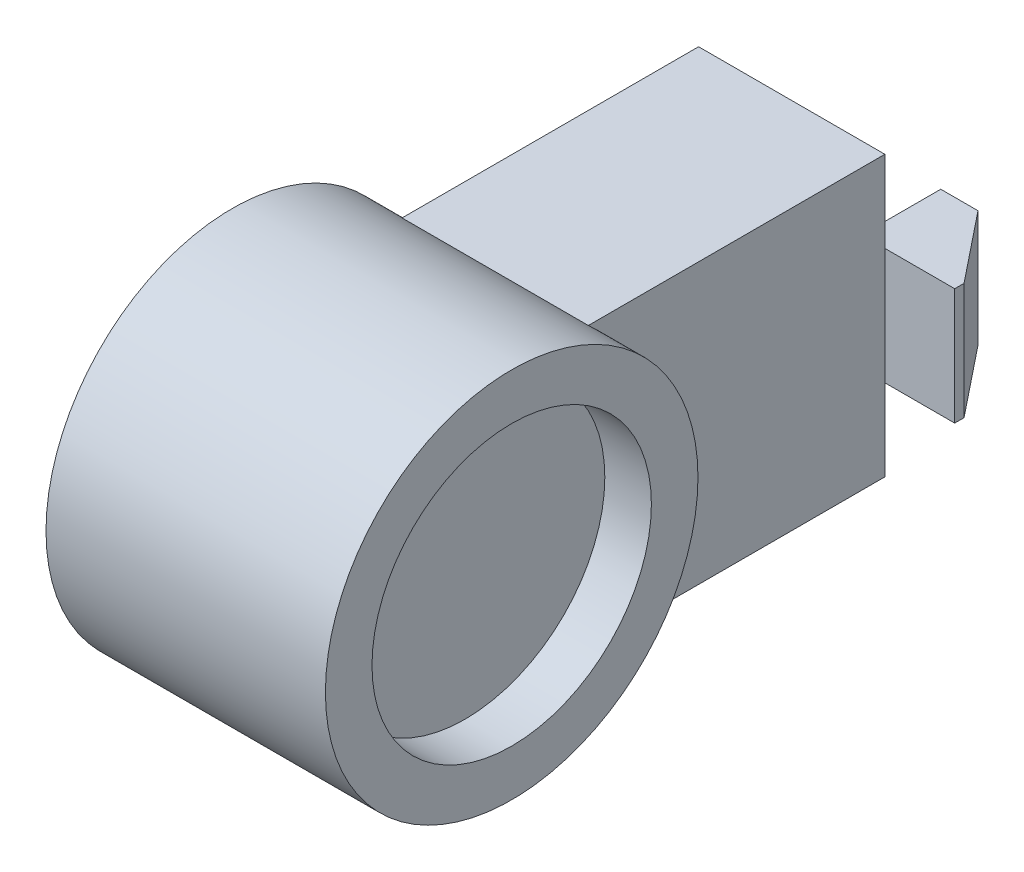
ISO-10303-21;
HEADER;
FILE_DESCRIPTION(('STEP AP214'),'2;1');
FILE_NAME('part.step','',(''),(''),'','','');
FILE_SCHEMA(('AUTOMOTIVE_DESIGN { 1 0 10303 214 1 1 1 1 }'));
ENDSEC;
DATA;
#1=APPLICATION_CONTEXT('core data for automotive mechanical design processes');
#2=APPLICATION_PROTOCOL_DEFINITION('international standard','automotive_design',2000,#1);
#3=PRODUCT_CONTEXT('',#1,'mechanical');
#4=PRODUCT('Part','Part','',(#3));
#5=PRODUCT_RELATED_PRODUCT_CATEGORY('part','',(#4));
#6=PRODUCT_DEFINITION_FORMATION('','',#4);
#7=PRODUCT_DEFINITION_CONTEXT('part definition',#1,'design');
#8=PRODUCT_DEFINITION('design','',#6,#7);
#9=PRODUCT_DEFINITION_SHAPE('','',#8);
#10=(LENGTH_UNIT() NAMED_UNIT(*) SI_UNIT(.MILLI.,.METRE.));
#11=(NAMED_UNIT(*) PLANE_ANGLE_UNIT() SI_UNIT($,.RADIAN.));
#12=(NAMED_UNIT(*) SI_UNIT($,.STERADIAN.) SOLID_ANGLE_UNIT());
#13=UNCERTAINTY_MEASURE_WITH_UNIT(LENGTH_MEASURE(1.E-05),#10,'distance_accuracy_value','');
#14=(GEOMETRIC_REPRESENTATION_CONTEXT(3) GLOBAL_UNCERTAINTY_ASSIGNED_CONTEXT((#13)) GLOBAL_UNIT_ASSIGNED_CONTEXT((#10,
#11,#12)) REPRESENTATION_CONTEXT('',''));
#15=CARTESIAN_POINT('',(0.,0.,0.));
#16=DIRECTION('',(0.,0.,1.));
#17=DIRECTION('',(1.,0.,0.));
#18=AXIS2_PLACEMENT_3D('',#15,#16,#17);
#19=CARTESIAN_POINT('',(0.,0.,-92.1328056902551));
#20=DIRECTION('',(0.,0.,-1.));
#21=DIRECTION('',(-1.,0.,0.));
#22=AXIS2_PLACEMENT_3D('',#19,#20,#21);
#23=PLANE('',#22);
#24=DIRECTION('',(0.,1.,0.));
#25=VECTOR('',#24,1.);
#26=CARTESIAN_POINT('',(45.,-12.5000000000007,-92.1328056902551));
#27=LINE('',#26,#25);
#28=CARTESIAN_POINT('',(45.,-12.5000000000007,-92.1328056902551));
#29=VERTEX_POINT('',#28);
#30=CARTESIAN_POINT('',(45.,12.4999999999994,-92.1328056902551));
#31=VERTEX_POINT('',#30);
#32=EDGE_CURVE('E170',#29,#31,#27,.T.);
#33=ORIENTED_EDGE('',*,*,#32,.F.);
#34=DIRECTION('',(-1.,0.,0.));
#35=VECTOR('',#34,1.);
#36=CARTESIAN_POINT('',(65.,-12.5000000000006,-92.1328056902551));
#37=LINE('',#36,#35);
#38=CARTESIAN_POINT('',(15.,-12.5000000000007,-92.1328056902551));
#39=VERTEX_POINT('',#38);
#40=EDGE_CURVE('E181',#29,#39,#37,.T.);
#41=ORIENTED_EDGE('',*,*,#40,.T.);
#42=DIRECTION('',(0.,1.,0.));
#43=VECTOR('',#42,1.);
#44=CARTESIAN_POINT('',(15.,-12.5000000000007,-92.1328056902551));
#45=LINE('',#44,#43);
#46=CARTESIAN_POINT('',(15.,12.4999999999994,-92.1328056902551));
#47=VERTEX_POINT('',#46);
#48=EDGE_CURVE('E220',#39,#47,#45,.T.);
#49=ORIENTED_EDGE('',*,*,#48,.T.);
#50=DIRECTION('',(1.,0.,0.));
#51=VECTOR('',#50,1.);
#52=CARTESIAN_POINT('',(65.,12.4999999999994,-92.1328056902551));
#53=LINE('',#52,#51);
#54=EDGE_CURVE('E59',#47,#31,#53,.T.);
#55=ORIENTED_EDGE('',*,*,#54,.T.);
#56=EDGE_LOOP('',(#33,#41,#49,#55));
#57=FACE_BOUND('',#56,.T.);
#58=ADVANCED_FACE('F39',(#57),#23,.T.);
#59=CARTESIAN_POINT('',(0.,0.,-90.1328056902551));
#60=DIRECTION('',(0.,0.,1.));
#61=DIRECTION('',(1.,0.,0.));
#62=AXIS2_PLACEMENT_3D('',#59,#60,#61);
#63=PLANE('',#62);
#64=DIRECTION('',(-1.,0.,0.));
#65=VECTOR('',#64,1.);
#66=CARTESIAN_POINT('',(65.,-12.5000000000006,-90.1328056902551));
#67=LINE('',#66,#65);
#68=CARTESIAN_POINT('',(50.,-12.5000000000006,-90.1328056902551));
#69=VERTEX_POINT('',#68);
#70=CARTESIAN_POINT('',(10.,-12.5000000000006,-90.1328056902551));
#71=VERTEX_POINT('',#70);
#72=EDGE_CURVE('E11',#69,#71,#67,.T.);
#73=ORIENTED_EDGE('',*,*,#72,.F.);
#74=DIRECTION('',(0.,1.,0.));
#75=VECTOR('',#74,1.);
#76=CARTESIAN_POINT('',(50.,29.9999999999994,-90.1328056902551));
#77=LINE('',#76,#75);
#78=CARTESIAN_POINT('',(50.,-30.0000000000006,-90.1328056902551));
#79=VERTEX_POINT('',#78);
#80=EDGE_CURVE('E297',#79,#69,#77,.T.);
#81=ORIENTED_EDGE('',*,*,#80,.F.);
#82=DIRECTION('',(1.,0.,0.));
#83=VECTOR('',#82,1.);
#84=CARTESIAN_POINT('',(10.,-30.0000000000006,-90.1328056902551));
#85=LINE('',#84,#83);
#86=CARTESIAN_POINT('',(10.,-30.0000000000006,-90.1328056902551));
#87=VERTEX_POINT('',#86);
#88=EDGE_CURVE('E279',#87,#79,#85,.T.);
#89=ORIENTED_EDGE('',*,*,#88,.F.);
#90=DIRECTION('',(0.,-1.,0.));
#91=VECTOR('',#90,1.);
#92=CARTESIAN_POINT('',(10.,29.9999999999994,-90.1328056902551));
#93=LINE('',#92,#91);
#94=EDGE_CURVE('E290',#71,#87,#93,.T.);
#95=ORIENTED_EDGE('',*,*,#94,.F.);
#96=EDGE_LOOP('',(#73,#81,#89,#95));
#97=FACE_BOUND('',#96,.T.);
#98=ADVANCED_FACE('F352',(#97),#63,.F.);
#99=DIRECTION('',(1.,0.,0.));
#100=VECTOR('',#99,1.);
#101=CARTESIAN_POINT('',(65.,12.4999999999994,-90.1328056902551));
#102=LINE('',#101,#100);
#103=CARTESIAN_POINT('',(10.,12.4999999999994,-90.1328056902551));
#104=VERTEX_POINT('',#103);
#105=CARTESIAN_POINT('',(50.,12.4999999999994,-90.1328056902551));
#106=VERTEX_POINT('',#105);
#107=EDGE_CURVE('E49',#104,#106,#102,.T.);
#108=ORIENTED_EDGE('',*,*,#107,.F.);
#109=CARTESIAN_POINT('',(10.,29.9999999999994,-90.1328056902551));
#110=VERTEX_POINT('',#109);
#111=EDGE_CURVE('E285',#110,#104,#93,.T.);
#112=ORIENTED_EDGE('',*,*,#111,.F.);
#113=DIRECTION('',(-1.,0.,0.));
#114=VECTOR('',#113,1.);
#115=CARTESIAN_POINT('',(10.,29.9999999999994,-90.1328056902551));
#116=LINE('',#115,#114);
#117=CARTESIAN_POINT('',(50.,29.9999999999994,-90.1328056902551));
#118=VERTEX_POINT('',#117);
#119=EDGE_CURVE('E291',#118,#110,#116,.T.);
#120=ORIENTED_EDGE('',*,*,#119,.F.);
#121=EDGE_CURVE('E302',#106,#118,#77,.T.);
#122=ORIENTED_EDGE('',*,*,#121,.F.);
#123=EDGE_LOOP('',(#108,#112,#120,#122));
#124=FACE_BOUND('',#123,.T.);
#125=ADVANCED_FACE('F357',(#124),#63,.F.);
#126=CARTESIAN_POINT('',(60.,0.,0.));
#127=DIRECTION('',(-1.,0.,0.));
#128=DIRECTION('',(0.,0.,1.));
#129=AXIS2_PLACEMENT_3D('',#126,#127,#128);
#130=CYLINDRICAL_SURFACE('',#129,40.);
#131=CARTESIAN_POINT('',(0.,0.,0.));
#132=DIRECTION('',(1.,0.,0.));
#133=DIRECTION('',(0.,0.,-1.));
#134=AXIS2_PLACEMENT_3D('',#131,#132,#133);
#135=CIRCLE('',#134,40.);
#136=CARTESIAN_POINT('',(0.,0.,-40.));
#137=VERTEX_POINT('',#136);
#138=EDGE_CURVE('E43',#137,#137,#135,.T.);
#139=ORIENTED_EDGE('',*,*,#138,.T.);
#140=EDGE_LOOP('',(#139));
#141=FACE_BOUND('',#140,.T.);
#142=CARTESIAN_POINT('',(60.,0.,0.));
#143=DIRECTION('',(1.,0.,0.));
#144=DIRECTION('',(0.,0.,-1.));
#145=AXIS2_PLACEMENT_3D('',#142,#143,#144);
#146=CIRCLE('',#145,40.);
#147=CARTESIAN_POINT('',(60.,0.,-40.));
#148=VERTEX_POINT('',#147);
#149=EDGE_CURVE('E323',#148,#148,#146,.T.);
#150=ORIENTED_EDGE('',*,*,#149,.F.);
#151=EDGE_LOOP('',(#150));
#152=FACE_BOUND('',#151,.T.);
#153=CARTESIAN_POINT('',(50.,0.,0.));
#154=DIRECTION('',(-1.,0.,0.));
#155=DIRECTION('',(0.,-1.,0.));
#156=AXIS2_PLACEMENT_3D('',#153,#154,#155);
#157=CIRCLE('',#156,40.);
#158=CARTESIAN_POINT('',(50.,-30.0000000000006,-26.4575131106452));
#159=VERTEX_POINT('',#158);
#160=CARTESIAN_POINT('',(50.,29.9999999999994,-26.4575131106466));
#161=VERTEX_POINT('',#160);
#162=EDGE_CURVE('E283',#159,#161,#157,.F.);
#163=ORIENTED_EDGE('',*,*,#162,.T.);
#164=DIRECTION('',(-1.,0.,0.));
#165=VECTOR('',#164,1.);
#166=CARTESIAN_POINT('',(60.,29.9999999999994,-26.4575131106466));
#167=LINE('',#166,#165);
#168=CARTESIAN_POINT('',(10.,29.9999999999994,-26.4575131106466));
#169=VERTEX_POINT('',#168);
#170=EDGE_CURVE('E319',#161,#169,#167,.T.);
#171=ORIENTED_EDGE('',*,*,#170,.T.);
#172=CARTESIAN_POINT('',(10.,0.,0.));
#173=DIRECTION('',(1.,0.,0.));
#174=DIRECTION('',(0.,1.,0.));
#175=AXIS2_PLACEMENT_3D('',#172,#173,#174);
#176=CIRCLE('',#175,40.);
#177=CARTESIAN_POINT('',(10.,-30.0000000000006,-26.4575131106452));
#178=VERTEX_POINT('',#177);
#179=EDGE_CURVE('E316',#169,#178,#176,.F.);
#180=ORIENTED_EDGE('',*,*,#179,.T.);
#181=DIRECTION('',(-1.,0.,0.));
#182=VECTOR('',#181,1.);
#183=CARTESIAN_POINT('',(60.,-30.0000000000006,-26.4575131106452));
#184=LINE('',#183,#182);
#185=EDGE_CURVE('E313',#178,#159,#184,.F.);
#186=ORIENTED_EDGE('',*,*,#185,.T.);
#187=EDGE_LOOP('',(#163,#171,#180,#186));
#188=FACE_BOUND('',#187,.T.);
#189=ADVANCED_FACE('F41',(#141,#152,#188),#130,.T.);
#190=CARTESIAN_POINT('',(60.,0.,0.));
#191=DIRECTION('',(1.,0.,0.));
#192=DIRECTION('',(0.,0.,-1.));
#193=AXIS2_PLACEMENT_3D('',#190,#191,#192);
#194=PLANE('',#193);
#195=CARTESIAN_POINT('',(60.,0.,0.));
#196=DIRECTION('',(1.,0.,0.));
#197=DIRECTION('',(0.,0.,-1.));
#198=AXIS2_PLACEMENT_3D('',#195,#196,#197);
#199=CIRCLE('',#198,30.);
#200=CARTESIAN_POINT('',(60.,0.,-30.));
#201=VERTEX_POINT('',#200);
#202=EDGE_CURVE('E193',#201,#201,#199,.T.);
#203=ORIENTED_EDGE('',*,*,#202,.F.);
#204=EDGE_LOOP('',(#203));
#205=FACE_BOUND('',#204,.T.);
#206=ORIENTED_EDGE('',*,*,#149,.T.);
#207=EDGE_LOOP('',(#206));
#208=FACE_BOUND('',#207,.T.);
#209=ADVANCED_FACE('F339',(#205,#208),#194,.T.);
#210=CARTESIAN_POINT('',(0.,0.,0.));
#211=DIRECTION('',(1.,0.,0.));
#212=DIRECTION('',(0.,0.,-1.));
#213=AXIS2_PLACEMENT_3D('',#210,#211,#212);
#214=PLANE('',#213);
#215=CARTESIAN_POINT('',(0.,0.,0.));
#216=DIRECTION('',(-1.,0.,0.));
#217=DIRECTION('',(0.,0.,1.));
#218=AXIS2_PLACEMENT_3D('',#215,#216,#217);
#219=CIRCLE('',#218,6.);
#220=CARTESIAN_POINT('',(0.,0.,6.));
#221=VERTEX_POINT('',#220);
#222=EDGE_CURVE('E473',#221,#221,#219,.T.);
#223=ORIENTED_EDGE('',*,*,#222,.F.);
#224=EDGE_LOOP('',(#223));
#225=FACE_BOUND('',#224,.T.);
#226=ORIENTED_EDGE('',*,*,#138,.F.);
#227=EDGE_LOOP('',(#226));
#228=FACE_BOUND('',#227,.T.);
#229=ADVANCED_FACE('F336',(#225,#228),#214,.F.);
#230=CARTESIAN_POINT('',(50.,29.9999999999994,40.001));
#231=DIRECTION('',(-1.,0.,0.));
#232=DIRECTION('',(0.,-1.,0.));
#233=AXIS2_PLACEMENT_3D('',#230,#231,#232);
#234=PLANE('',#233);
#235=ORIENTED_EDGE('',*,*,#162,.F.);
#236=DIRECTION('',(0.,0.,-1.));
#237=VECTOR('',#236,1.);
#238=CARTESIAN_POINT('',(50.,-30.0000000000006,40.001));
#239=LINE('',#238,#237);
#240=EDGE_CURVE('E278',#159,#79,#239,.T.);
#241=ORIENTED_EDGE('',*,*,#240,.T.);
#242=ORIENTED_EDGE('',*,*,#80,.T.);
#243=EDGE_CURVE('E301',#69,#106,#77,.T.);
#244=ORIENTED_EDGE('',*,*,#243,.T.);
#245=ORIENTED_EDGE('',*,*,#121,.T.);
#246=DIRECTION('',(0.,0.,-1.));
#247=VECTOR('',#246,1.);
#248=CARTESIAN_POINT('',(50.,29.9999999999994,40.001));
#249=LINE('',#248,#247);
#250=EDGE_CURVE('E296',#161,#118,#249,.T.);
#251=ORIENTED_EDGE('',*,*,#250,.F.);
#252=EDGE_LOOP('',(#235,#241,#242,#244,#245,#251));
#253=FACE_BOUND('',#252,.T.);
#254=ADVANCED_FACE('F338',(#253),#234,.F.);
#255=CARTESIAN_POINT('',(10.,29.9999999999994,40.001));
#256=DIRECTION('',(0.,-1.,0.));
#257=DIRECTION('',(0.,0.,-1.));
#258=AXIS2_PLACEMENT_3D('',#255,#256,#257);
#259=PLANE('',#258);
#260=ORIENTED_EDGE('',*,*,#170,.F.);
#261=ORIENTED_EDGE('',*,*,#250,.T.);
#262=ORIENTED_EDGE('',*,*,#119,.T.);
#263=DIRECTION('',(0.,0.,-1.));
#264=VECTOR('',#263,1.);
#265=CARTESIAN_POINT('',(10.,29.9999999999994,40.001));
#266=LINE('',#265,#264);
#267=EDGE_CURVE('E295',#169,#110,#266,.T.);
#268=ORIENTED_EDGE('',*,*,#267,.F.);
#269=EDGE_LOOP('',(#260,#261,#262,#268));
#270=FACE_BOUND('',#269,.T.);
#271=ADVANCED_FACE('F345',(#270),#259,.F.);
#272=CARTESIAN_POINT('',(10.,29.9999999999994,40.001));
#273=DIRECTION('',(1.,0.,0.));
#274=DIRECTION('',(0.,1.,0.));
#275=AXIS2_PLACEMENT_3D('',#272,#273,#274);
#276=PLANE('',#275);
#277=ORIENTED_EDGE('',*,*,#179,.F.);
#278=ORIENTED_EDGE('',*,*,#267,.T.);
#279=ORIENTED_EDGE('',*,*,#111,.T.);
#280=EDGE_CURVE('E289',#104,#71,#93,.T.);
#281=ORIENTED_EDGE('',*,*,#280,.T.);
#282=ORIENTED_EDGE('',*,*,#94,.T.);
#283=DIRECTION('',(0.,0.,-1.));
#284=VECTOR('',#283,1.);
#285=CARTESIAN_POINT('',(10.,-30.0000000000006,40.001));
#286=LINE('',#285,#284);
#287=EDGE_CURVE('E284',#178,#87,#286,.T.);
#288=ORIENTED_EDGE('',*,*,#287,.F.);
#289=EDGE_LOOP('',(#277,#278,#279,#281,#282,#288));
#290=FACE_BOUND('',#289,.T.);
#291=ADVANCED_FACE('F386',(#290),#276,.F.);
#292=CARTESIAN_POINT('',(10.,-30.0000000000006,40.001));
#293=DIRECTION('',(0.,1.,0.));
#294=DIRECTION('',(0.,0.,1.));
#295=AXIS2_PLACEMENT_3D('',#292,#293,#294);
#296=PLANE('',#295);
#297=ORIENTED_EDGE('',*,*,#185,.F.);
#298=ORIENTED_EDGE('',*,*,#287,.T.);
#299=ORIENTED_EDGE('',*,*,#88,.T.);
#300=ORIENTED_EDGE('',*,*,#240,.F.);
#301=EDGE_LOOP('',(#297,#298,#299,#300));
#302=FACE_BOUND('',#301,.T.);
#303=ADVANCED_FACE('F390',(#302),#296,.F.);
#304=CARTESIAN_POINT('',(0.,0.,-90.1328056902551));
#305=DIRECTION('',(0.,0.,-1.));
#306=DIRECTION('',(-1.,0.,0.));
#307=AXIS2_PLACEMENT_3D('',#304,#305,#306);
#308=PLANE('',#307);
#309=ORIENTED_EDGE('',*,*,#243,.F.);
#310=CARTESIAN_POINT('',(65.,-12.5000000000006,-90.1328056902551));
#311=VERTEX_POINT('',#310);
#312=EDGE_CURVE('E51',#311,#69,#67,.T.);
#313=ORIENTED_EDGE('',*,*,#312,.F.);
#314=DIRECTION('',(0.,-1.,0.));
#315=VECTOR('',#314,1.);
#316=CARTESIAN_POINT('',(65.,12.4999999999994,-90.1328056902551));
#317=LINE('',#316,#315);
#318=CARTESIAN_POINT('',(65.,12.4999999999994,-90.1328056902551));
#319=VERTEX_POINT('',#318);
#320=EDGE_CURVE('E259',#319,#311,#317,.T.);
#321=ORIENTED_EDGE('',*,*,#320,.F.);
#322=EDGE_CURVE('E254',#106,#319,#102,.T.);
#323=ORIENTED_EDGE('',*,*,#322,.F.);
#324=EDGE_LOOP('',(#309,#313,#321,#323));
#325=FACE_BOUND('',#324,.T.);
#326=ADVANCED_FACE('F369',(#325),#308,.F.);
#327=CARTESIAN_POINT('',(-5.,12.4999999999994,-92.1328056902551));
#328=DIRECTION('',(1.,0.,0.));
#329=DIRECTION('',(0.,1.,0.));
#330=AXIS2_PLACEMENT_3D('',#327,#328,#329);
#331=PLANE('',#330);
#332=DIRECTION('',(0.,1.,0.));
#333=VECTOR('',#332,1.);
#334=CARTESIAN_POINT('',(-5.,12.4999999999994,-90.1328056902551));
#335=LINE('',#334,#333);
#336=CARTESIAN_POINT('',(-5.00000000000001,-12.5000000000006,-90.1328056902551));
#337=VERTEX_POINT('',#336);
#338=CARTESIAN_POINT('',(-5.,12.4999999999994,-90.1328056902551));
#339=VERTEX_POINT('',#338);
#340=EDGE_CURVE('E233',#337,#339,#335,.T.);
#341=ORIENTED_EDGE('',*,*,#340,.T.);
#342=DIRECTION('',(0.,0.,1.));
#343=VECTOR('',#342,1.);
#344=CARTESIAN_POINT('',(-5.,12.4999999999994,-92.1328056902551));
#345=LINE('',#344,#343);
#346=CARTESIAN_POINT('',(-5.,12.4999999999994,-92.1328056902551));
#347=VERTEX_POINT('',#346);
#348=EDGE_CURVE('E274',#347,#339,#345,.T.);
#349=ORIENTED_EDGE('',*,*,#348,.F.);
#350=DIRECTION('',(0.,1.,0.));
#351=VECTOR('',#350,1.);
#352=CARTESIAN_POINT('',(-5.,12.4999999999994,-92.1328056902551));
#353=LINE('',#352,#351);
#354=CARTESIAN_POINT('',(-5.,-12.5000000000007,-92.1328056902551));
#355=VERTEX_POINT('',#354);
#356=EDGE_CURVE('E239',#355,#347,#353,.T.);
#357=ORIENTED_EDGE('',*,*,#356,.F.);
#358=DIRECTION('',(0.,0.,1.));
#359=VECTOR('',#358,1.);
#360=CARTESIAN_POINT('',(-5.00000000000001,-12.5000000000006,-92.1328056902551));
#361=LINE('',#360,#359);
#362=EDGE_CURVE('E250',#355,#337,#361,.T.);
#363=ORIENTED_EDGE('',*,*,#362,.T.);
#364=EDGE_LOOP('',(#341,#349,#357,#363));
#365=FACE_BOUND('',#364,.T.);
#366=ADVANCED_FACE('F379',(#365),#331,.F.);
#367=CARTESIAN_POINT('',(65.,12.4999999999994,-92.1328056902551));
#368=DIRECTION('',(0.,-1.,0.));
#369=DIRECTION('',(0.,0.,-1.));
#370=AXIS2_PLACEMENT_3D('',#367,#368,#369);
#371=PLANE('',#370);
#372=EDGE_CURVE('E255',#339,#104,#102,.T.);
#373=ORIENTED_EDGE('',*,*,#372,.T.);
#374=ORIENTED_EDGE('',*,*,#107,.T.);
#375=ORIENTED_EDGE('',*,*,#322,.T.);
#376=DIRECTION('',(0.,0.,1.));
#377=VECTOR('',#376,1.);
#378=CARTESIAN_POINT('',(65.,12.4999999999994,-92.1328056902551));
#379=LINE('',#378,#377);
#380=CARTESIAN_POINT('',(65.,12.4999999999994,-92.1328056902551));
#381=VERTEX_POINT('',#380);
#382=EDGE_CURVE('E270',#381,#319,#379,.T.);
#383=ORIENTED_EDGE('',*,*,#382,.F.);
#384=DIRECTION('',(-0.624695047554424,0.,-0.78086880944303));
#385=VECTOR('',#384,1.);
#386=CARTESIAN_POINT('',(65.,12.4999999999994,-92.1328056902551));
#387=LINE('',#386,#385);
#388=CARTESIAN_POINT('',(53.,12.4999999999994,-107.132805690255));
#389=VERTEX_POINT('',#388);
#390=EDGE_CURVE('E187',#381,#389,#387,.T.);
#391=ORIENTED_EDGE('',*,*,#390,.T.);
#392=DIRECTION('',(-1.,0.,0.));
#393=VECTOR('',#392,1.);
#394=CARTESIAN_POINT('',(53.,12.4999999999994,-107.132805690255));
#395=LINE('',#394,#393);
#396=CARTESIAN_POINT('',(45.,12.4999999999994,-107.132805690255));
#397=VERTEX_POINT('',#396);
#398=EDGE_CURVE('E198',#389,#397,#395,.T.);
#399=ORIENTED_EDGE('',*,*,#398,.T.);
#400=DIRECTION('',(0.,0.,1.));
#401=VECTOR('',#400,1.);
#402=CARTESIAN_POINT('',(45.,12.4999999999994,-107.132805690255));
#403=LINE('',#402,#401);
#404=EDGE_CURVE('E164',#397,#31,#403,.T.);
#405=ORIENTED_EDGE('',*,*,#404,.T.);
#406=ORIENTED_EDGE('',*,*,#54,.F.);
#407=DIRECTION('',(0.,0.,-1.));
#408=VECTOR('',#407,1.);
#409=CARTESIAN_POINT('',(15.,12.4999999999994,-107.132805690255));
#410=LINE('',#409,#408);
#411=CARTESIAN_POINT('',(15.,12.4999999999994,-107.132805690255));
#412=VERTEX_POINT('',#411);
#413=EDGE_CURVE('E67',#47,#412,#410,.T.);
#414=ORIENTED_EDGE('',*,*,#413,.T.);
#415=DIRECTION('',(-1.,0.,0.));
#416=VECTOR('',#415,1.);
#417=CARTESIAN_POINT('',(7.,12.4999999999994,-107.132805690255));
#418=LINE('',#417,#416);
#419=CARTESIAN_POINT('',(7.,12.4999999999994,-107.132805690255));
#420=VERTEX_POINT('',#419);
#421=EDGE_CURVE('E223',#412,#420,#418,.T.);
#422=ORIENTED_EDGE('',*,*,#421,.T.);
#423=DIRECTION('',(-0.624695047554424,0.,0.78086880944303));
#424=VECTOR('',#423,1.);
#425=CARTESIAN_POINT('',(-5.,12.4999999999994,-92.1328056902551));
#426=LINE('',#425,#424);
#427=EDGE_CURVE('E213',#420,#347,#426,.T.);
#428=ORIENTED_EDGE('',*,*,#427,.T.);
#429=ORIENTED_EDGE('',*,*,#348,.T.);
#430=EDGE_LOOP('',(#373,#374,#375,#383,#391,#399,#405,#406,#414,#422,#428,#429));
#431=FACE_BOUND('',#430,.T.);
#432=ADVANCED_FACE('F375',(#431),#371,.F.);
#433=CARTESIAN_POINT('',(65.,12.4999999999994,-92.1328056902551));
#434=DIRECTION('',(-1.,0.,0.));
#435=DIRECTION('',(0.,0.,1.));
#436=AXIS2_PLACEMENT_3D('',#433,#434,#435);
#437=PLANE('',#436);
#438=ORIENTED_EDGE('',*,*,#320,.T.);
#439=DIRECTION('',(0.,0.,1.));
#440=VECTOR('',#439,1.);
#441=CARTESIAN_POINT('',(65.,-12.5000000000006,-92.1328056902551));
#442=LINE('',#441,#440);
#443=CARTESIAN_POINT('',(65.,-12.5000000000006,-92.1328056902551));
#444=VERTEX_POINT('',#443);
#445=EDGE_CURVE('E266',#444,#311,#442,.T.);
#446=ORIENTED_EDGE('',*,*,#445,.F.);
#447=DIRECTION('',(0.,-1.,0.));
#448=VECTOR('',#447,1.);
#449=CARTESIAN_POINT('',(65.,12.4999999999994,-92.1328056902551));
#450=LINE('',#449,#448);
#451=EDGE_CURVE('E244',#381,#444,#450,.T.);
#452=ORIENTED_EDGE('',*,*,#451,.F.);
#453=ORIENTED_EDGE('',*,*,#382,.T.);
#454=EDGE_LOOP('',(#438,#446,#452,#453));
#455=FACE_BOUND('',#454,.T.);
#456=ADVANCED_FACE('F372',(#455),#437,.F.);
#457=CARTESIAN_POINT('',(65.,-12.5000000000006,-92.1328056902551));
#458=DIRECTION('',(0.,1.,0.));
#459=DIRECTION('',(0.,0.,1.));
#460=AXIS2_PLACEMENT_3D('',#457,#458,#459);
#461=PLANE('',#460);
#462=ORIENTED_EDGE('',*,*,#312,.T.);
#463=ORIENTED_EDGE('',*,*,#72,.T.);
#464=EDGE_CURVE('E52',#71,#337,#67,.T.);
#465=ORIENTED_EDGE('',*,*,#464,.T.);
#466=ORIENTED_EDGE('',*,*,#362,.F.);
#467=DIRECTION('',(-0.624695047554424,0.,0.78086880944303));
#468=VECTOR('',#467,1.);
#469=CARTESIAN_POINT('',(-5.,-12.5000000000007,-92.1328056902551));
#470=LINE('',#469,#468);
#471=CARTESIAN_POINT('',(7.,-12.5000000000007,-107.132805690255));
#472=VERTEX_POINT('',#471);
#473=EDGE_CURVE('E217',#472,#355,#470,.T.);
#474=ORIENTED_EDGE('',*,*,#473,.F.);
#475=DIRECTION('',(-1.,0.,0.));
#476=VECTOR('',#475,1.);
#477=CARTESIAN_POINT('',(7.,-12.5000000000007,-107.132805690255));
#478=LINE('',#477,#476);
#479=CARTESIAN_POINT('',(15.,-12.5000000000007,-107.132805690255));
#480=VERTEX_POINT('',#479);
#481=EDGE_CURVE('E212',#480,#472,#478,.T.);
#482=ORIENTED_EDGE('',*,*,#481,.F.);
#483=DIRECTION('',(0.,0.,-1.));
#484=VECTOR('',#483,1.);
#485=CARTESIAN_POINT('',(15.,-12.5000000000007,-107.132805690255));
#486=LINE('',#485,#484);
#487=EDGE_CURVE('E208',#39,#480,#486,.T.);
#488=ORIENTED_EDGE('',*,*,#487,.F.);
#489=ORIENTED_EDGE('',*,*,#40,.F.);
#490=DIRECTION('',(0.,0.,1.));
#491=VECTOR('',#490,1.);
#492=CARTESIAN_POINT('',(45.,-12.5000000000007,-107.132805690255));
#493=LINE('',#492,#491);
#494=CARTESIAN_POINT('',(45.,-12.5000000000007,-107.132805690255));
#495=VERTEX_POINT('',#494);
#496=EDGE_CURVE('E162',#495,#29,#493,.T.);
#497=ORIENTED_EDGE('',*,*,#496,.F.);
#498=DIRECTION('',(-1.,0.,0.));
#499=VECTOR('',#498,1.);
#500=CARTESIAN_POINT('',(53.,-12.5000000000007,-107.132805690255));
#501=LINE('',#500,#499);
#502=CARTESIAN_POINT('',(53.,-12.5000000000007,-107.132805690255));
#503=VERTEX_POINT('',#502);
#504=EDGE_CURVE('E178',#503,#495,#501,.T.);
#505=ORIENTED_EDGE('',*,*,#504,.F.);
#506=DIRECTION('',(-0.624695047554424,0.,-0.78086880944303));
#507=VECTOR('',#506,1.);
#508=CARTESIAN_POINT('',(65.,-12.5000000000007,-92.1328056902551));
#509=LINE('',#508,#507);
#510=EDGE_CURVE('E171',#444,#503,#509,.T.);
#511=ORIENTED_EDGE('',*,*,#510,.F.);
#512=ORIENTED_EDGE('',*,*,#445,.T.);
#513=EDGE_LOOP('',(#462,#463,#465,#466,#474,#482,#488,#489,#497,#505,#511,#512));
#514=FACE_BOUND('',#513,.T.);
#515=ADVANCED_FACE('F176',(#514),#461,.F.);
#516=ORIENTED_EDGE('',*,*,#280,.F.);
#517=ORIENTED_EDGE('',*,*,#372,.F.);
#518=ORIENTED_EDGE('',*,*,#340,.F.);
#519=ORIENTED_EDGE('',*,*,#464,.F.);
#520=EDGE_LOOP('',(#516,#517,#518,#519));
#521=FACE_BOUND('',#520,.T.);
#522=ADVANCED_FACE('F364',(#521),#308,.F.);
#523=CARTESIAN_POINT('',(-5.,-12.5000000000007,-92.1328056902551));
#524=DIRECTION('',(-0.78086880944303,0.,-0.624695047554424));
#525=DIRECTION('',(-0.624695047554424,0.,0.78086880944303));
#526=AXIS2_PLACEMENT_3D('',#523,#524,#525);
#527=PLANE('',#526);
#528=ORIENTED_EDGE('',*,*,#427,.F.);
#529=DIRECTION('',(0.,1.,0.));
#530=VECTOR('',#529,1.);
#531=CARTESIAN_POINT('',(7.,-12.5000000000007,-107.132805690255));
#532=LINE('',#531,#530);
#533=EDGE_CURVE('E230',#472,#420,#532,.T.);
#534=ORIENTED_EDGE('',*,*,#533,.F.);
#535=ORIENTED_EDGE('',*,*,#473,.T.);
#536=ORIENTED_EDGE('',*,*,#356,.T.);
#537=EDGE_LOOP('',(#528,#534,#535,#536));
#538=FACE_BOUND('',#537,.T.);
#539=ADVANCED_FACE('F367',(#538),#527,.T.);
#540=CARTESIAN_POINT('',(7.,-12.5000000000007,-107.132805690255));
#541=DIRECTION('',(0.,0.,-1.));
#542=DIRECTION('',(-1.,0.,0.));
#543=AXIS2_PLACEMENT_3D('',#540,#541,#542);
#544=PLANE('',#543);
#545=ORIENTED_EDGE('',*,*,#421,.F.);
#546=DIRECTION('',(0.,1.,0.));
#547=VECTOR('',#546,1.);
#548=CARTESIAN_POINT('',(15.,-12.5000000000007,-107.132805690255));
#549=LINE('',#548,#547);
#550=EDGE_CURVE('E234',#480,#412,#549,.T.);
#551=ORIENTED_EDGE('',*,*,#550,.F.);
#552=ORIENTED_EDGE('',*,*,#481,.T.);
#553=ORIENTED_EDGE('',*,*,#533,.T.);
#554=EDGE_LOOP('',(#545,#551,#552,#553));
#555=FACE_BOUND('',#554,.T.);
#556=ADVANCED_FACE('F436',(#555),#544,.T.);
#557=CARTESIAN_POINT('',(15.,-12.5000000000007,-107.132805690255));
#558=DIRECTION('',(1.,0.,0.));
#559=DIRECTION('',(0.,0.,-1.));
#560=AXIS2_PLACEMENT_3D('',#557,#558,#559);
#561=PLANE('',#560);
#562=ORIENTED_EDGE('',*,*,#413,.F.);
#563=ORIENTED_EDGE('',*,*,#48,.F.);
#564=ORIENTED_EDGE('',*,*,#487,.T.);
#565=ORIENTED_EDGE('',*,*,#550,.T.);
#566=EDGE_LOOP('',(#562,#563,#564,#565));
#567=FACE_BOUND('',#566,.T.);
#568=ADVANCED_FACE('F362',(#567),#561,.T.);
#569=CARTESIAN_POINT('',(53.,-12.5000000000007,-107.132805690255));
#570=DIRECTION('',(0.,0.,-1.));
#571=DIRECTION('',(-1.,0.,0.));
#572=AXIS2_PLACEMENT_3D('',#569,#570,#571);
#573=PLANE('',#572);
#574=ORIENTED_EDGE('',*,*,#398,.F.);
#575=DIRECTION('',(0.,1.,0.));
#576=VECTOR('',#575,1.);
#577=CARTESIAN_POINT('',(53.,-12.5000000000007,-107.132805690255));
#578=LINE('',#577,#576);
#579=EDGE_CURVE('E185',#503,#389,#578,.T.);
#580=ORIENTED_EDGE('',*,*,#579,.F.);
#581=ORIENTED_EDGE('',*,*,#504,.T.);
#582=DIRECTION('',(0.,1.,0.));
#583=VECTOR('',#582,1.);
#584=CARTESIAN_POINT('',(45.,-12.5000000000007,-107.132805690255));
#585=LINE('',#584,#583);
#586=EDGE_CURVE('E159',#495,#397,#585,.T.);
#587=ORIENTED_EDGE('',*,*,#586,.T.);
#588=EDGE_LOOP('',(#574,#580,#581,#587));
#589=FACE_BOUND('',#588,.T.);
#590=ADVANCED_FACE('F184',(#589),#573,.T.);
#591=CARTESIAN_POINT('',(65.,-12.5000000000007,-92.1328056902551));
#592=DIRECTION('',(0.78086880944303,0.,-0.624695047554424));
#593=DIRECTION('',(-0.624695047554424,0.,-0.78086880944303));
#594=AXIS2_PLACEMENT_3D('',#591,#592,#593);
#595=PLANE('',#594);
#596=ORIENTED_EDGE('',*,*,#390,.F.);
#597=ORIENTED_EDGE('',*,*,#451,.T.);
#598=ORIENTED_EDGE('',*,*,#510,.T.);
#599=ORIENTED_EDGE('',*,*,#579,.T.);
#600=EDGE_LOOP('',(#596,#597,#598,#599));
#601=FACE_BOUND('',#600,.T.);
#602=ADVANCED_FACE('F432',(#601),#595,.T.);
#603=CARTESIAN_POINT('',(45.,-12.5000000000007,-107.132805690255));
#604=DIRECTION('',(-1.,0.,0.));
#605=DIRECTION('',(0.,0.,1.));
#606=AXIS2_PLACEMENT_3D('',#603,#604,#605);
#607=PLANE('',#606);
#608=ORIENTED_EDGE('',*,*,#404,.F.);
#609=ORIENTED_EDGE('',*,*,#586,.F.);
#610=ORIENTED_EDGE('',*,*,#496,.T.);
#611=ORIENTED_EDGE('',*,*,#32,.T.);
#612=EDGE_LOOP('',(#608,#609,#610,#611));
#613=FACE_BOUND('',#612,.T.);
#614=ADVANCED_FACE('F161',(#613),#607,.T.);
#615=CARTESIAN_POINT('',(50.,0.,0.));
#616=DIRECTION('',(1.,0.,0.));
#617=DIRECTION('',(0.,0.,-1.));
#618=AXIS2_PLACEMENT_3D('',#615,#616,#617);
#619=CYLINDRICAL_SURFACE('',#618,30.);
#620=CARTESIAN_POINT('',(50.,0.,0.));
#621=DIRECTION('',(1.,0.,0.));
#622=DIRECTION('',(0.,0.,-1.));
#623=AXIS2_PLACEMENT_3D('',#620,#621,#622);
#624=CIRCLE('',#623,30.);
#625=CARTESIAN_POINT('',(50.,0.,-30.));
#626=VERTEX_POINT('',#625);
#627=EDGE_CURVE('E201',#626,#626,#624,.T.);
#628=ORIENTED_EDGE('',*,*,#627,.F.);
#629=EDGE_LOOP('',(#628));
#630=FACE_BOUND('',#629,.T.);
#631=ORIENTED_EDGE('',*,*,#202,.T.);
#632=EDGE_LOOP('',(#631));
#633=FACE_BOUND('',#632,.T.);
#634=ADVANCED_FACE('F450',(#630,#633),#619,.F.);
#635=CARTESIAN_POINT('',(50.,0.,0.));
#636=DIRECTION('',(1.,0.,0.));
#637=DIRECTION('',(0.,0.,-1.));
#638=AXIS2_PLACEMENT_3D('',#635,#636,#637);
#639=PLANE('',#638);
#640=ORIENTED_EDGE('',*,*,#627,.T.);
#641=EDGE_LOOP('',(#640));
#642=FACE_BOUND('',#641,.T.);
#643=ADVANCED_FACE('F455',(#642),#639,.T.);
#644=CARTESIAN_POINT('',(6.,0.,0.));
#645=DIRECTION('',(-1.,0.,0.));
#646=DIRECTION('',(0.,0.,1.));
#647=AXIS2_PLACEMENT_3D('',#644,#645,#646);
#648=CYLINDRICAL_SURFACE('',#647,6.);
#649=CARTESIAN_POINT('',(6.,0.,0.));
#650=DIRECTION('',(-1.,0.,0.));
#651=DIRECTION('',(0.,0.,1.));
#652=AXIS2_PLACEMENT_3D('',#649,#650,#651);
#653=CIRCLE('',#652,6.);
#654=CARTESIAN_POINT('',(6.,0.,6.));
#655=VERTEX_POINT('',#654);
#656=EDGE_CURVE('E471',#655,#655,#653,.T.);
#657=ORIENTED_EDGE('',*,*,#656,.F.);
#658=EDGE_LOOP('',(#657));
#659=FACE_BOUND('',#658,.T.);
#660=ORIENTED_EDGE('',*,*,#222,.T.);
#661=EDGE_LOOP('',(#660));
#662=FACE_BOUND('',#661,.T.);
#663=ADVANCED_FACE('F459',(#659,#662),#648,.F.);
#664=CARTESIAN_POINT('',(6.,0.,0.));
#665=DIRECTION('',(-1.,0.,0.));
#666=DIRECTION('',(0.,0.,1.));
#667=AXIS2_PLACEMENT_3D('',#664,#665,#666);
#668=PLANE('',#667);
#669=ORIENTED_EDGE('',*,*,#656,.T.);
#670=EDGE_LOOP('',(#669));
#671=FACE_BOUND('',#670,.T.);
#672=ADVANCED_FACE('F463',(#671),#668,.T.);
#673=CLOSED_SHELL('',(#58,#98,#125,#189,#209,#229,#254,#271,#291,#303,#326,#366,#432,#456,#515,
#522,#539,#556,#568,#590,#602,#614,#634,#643,#663,#672));
#674=MANIFOLD_SOLID_BREP('B2',#673);
#675=ADVANCED_BREP_SHAPE_REPRESENTATION('',(#18,#674),#14);
#676=SHAPE_DEFINITION_REPRESENTATION(#9,#675);
ENDSEC;
END-ISO-10303-21;
